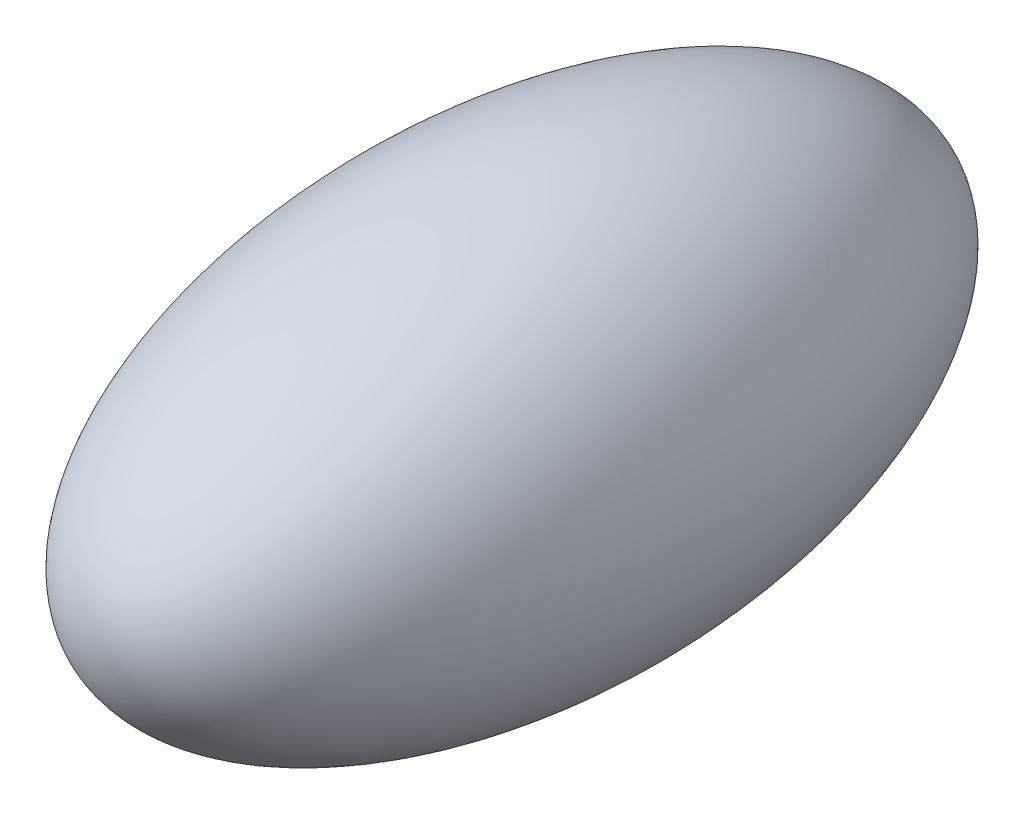
ISO-10303-21;
HEADER;
FILE_DESCRIPTION(('STEP AP214'),'2;1');
FILE_NAME('part.step','',(''),(''),'','','');
FILE_SCHEMA(('AUTOMOTIVE_DESIGN { 1 0 10303 214 1 1 1 1 }'));
ENDSEC;
DATA;
#1=APPLICATION_CONTEXT('core data for automotive mechanical design processes');
#2=APPLICATION_PROTOCOL_DEFINITION('international standard','automotive_design',2000,#1);
#3=PRODUCT_CONTEXT('',#1,'mechanical');
#4=PRODUCT('Part','Part','',(#3));
#5=PRODUCT_RELATED_PRODUCT_CATEGORY('part','',(#4));
#6=PRODUCT_DEFINITION_FORMATION('','',#4);
#7=PRODUCT_DEFINITION_CONTEXT('part definition',#1,'design');
#8=PRODUCT_DEFINITION('design','',#6,#7);
#9=PRODUCT_DEFINITION_SHAPE('','',#8);
#10=(LENGTH_UNIT() NAMED_UNIT(*) SI_UNIT(.MILLI.,.METRE.));
#11=(NAMED_UNIT(*) PLANE_ANGLE_UNIT() SI_UNIT($,.RADIAN.));
#12=(NAMED_UNIT(*) SI_UNIT($,.STERADIAN.) SOLID_ANGLE_UNIT());
#13=UNCERTAINTY_MEASURE_WITH_UNIT(LENGTH_MEASURE(1.E-05),#10,'distance_accuracy_value','');
#14=(GEOMETRIC_REPRESENTATION_CONTEXT(3) GLOBAL_UNCERTAINTY_ASSIGNED_CONTEXT((#13)) GLOBAL_UNIT_ASSIGNED_CONTEXT((#10,
#11,#12)) REPRESENTATION_CONTEXT('',''));
#15=CARTESIAN_POINT('',(0.,0.,0.));
#16=DIRECTION('',(0.,0.,1.));
#17=DIRECTION('',(1.,0.,0.));
#18=AXIS2_PLACEMENT_3D('',#15,#16,#17);
#19=CARTESIAN_POINT('',(0.,0.,0.));
#20=DIRECTION('',(1.,0.,0.));
#21=DIRECTION('',(0.,0.,-1.));
#22=AXIS2_PLACEMENT_3D('',#19,#20,#21);
#23=ELLIPSE('',#22,12.7,6.35);
#24=TRIMMED_CURVE('',#23,(PARAMETER_VALUE(0.)),(PARAMETER_VALUE(3.14159265358979)),.T.,.PARAMETER.);
#25=CARTESIAN_POINT('',(0.,0.,12.7));
#26=DIRECTION('',(0.,0.,1.));
#27=AXIS1_PLACEMENT('',#25,#26);
#28=SURFACE_OF_REVOLUTION('',#24,#27);
#29=CARTESIAN_POINT('',(0.,0.,12.7));
#30=VERTEX_POINT('',#29);
#31=VERTEX_LOOP('',#30);
#32=FACE_BOUND('',#31,.T.);
#33=CARTESIAN_POINT('',(0.,0.,-12.7));
#34=VERTEX_POINT('',#33);
#35=VERTEX_LOOP('',#34);
#36=FACE_BOUND('',#35,.T.);
#37=ADVANCED_FACE('F32',(#32,#36),#28,.T.);
#38=CLOSED_SHELL('',(#37));
#39=MANIFOLD_SOLID_BREP('B2',#38);
#40=ADVANCED_BREP_SHAPE_REPRESENTATION('',(#18,#39),#14);
#41=SHAPE_DEFINITION_REPRESENTATION(#9,#40);
ENDSEC;
END-ISO-10303-21;
